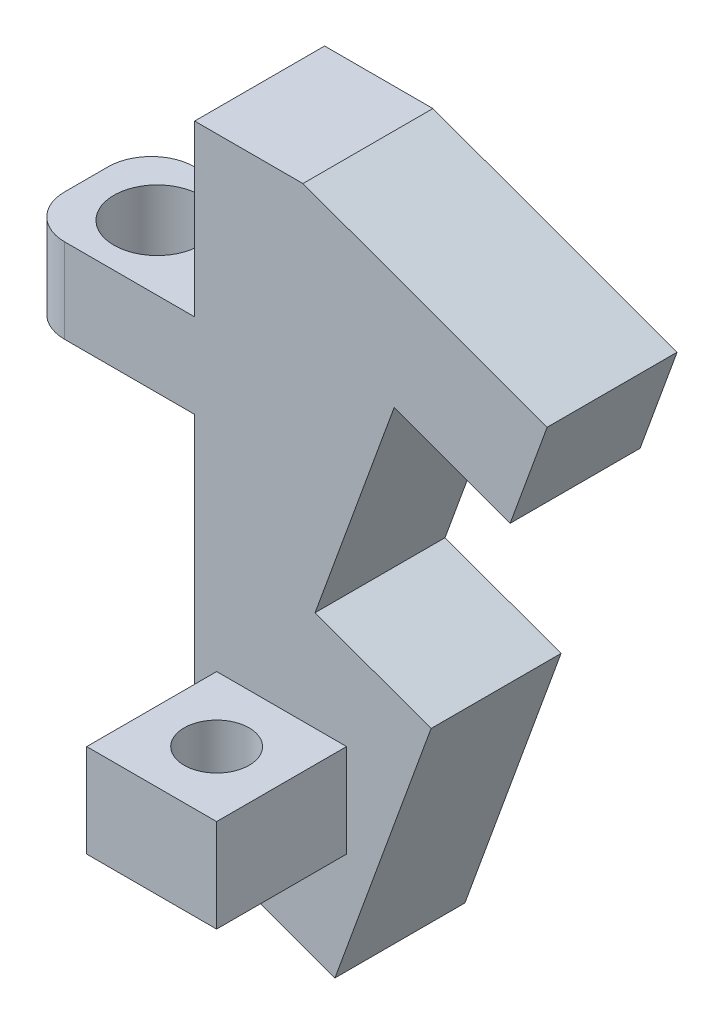
ISO-10303-21;
HEADER;
FILE_DESCRIPTION(('STEP AP214'),'2;1');
FILE_NAME('part.step','',(''),(''),'','','');
FILE_SCHEMA(('AUTOMOTIVE_DESIGN { 1 0 10303 214 1 1 1 1 }'));
ENDSEC;
DATA;
#1=APPLICATION_CONTEXT('core data for automotive mechanical design processes');
#2=APPLICATION_PROTOCOL_DEFINITION('international standard','automotive_design',2000,#1);
#3=PRODUCT_CONTEXT('',#1,'mechanical');
#4=PRODUCT('Part','Part','',(#3));
#5=PRODUCT_RELATED_PRODUCT_CATEGORY('part','',(#4));
#6=PRODUCT_DEFINITION_FORMATION('','',#4);
#7=PRODUCT_DEFINITION_CONTEXT('part definition',#1,'design');
#8=PRODUCT_DEFINITION('design','',#6,#7);
#9=PRODUCT_DEFINITION_SHAPE('','',#8);
#10=(LENGTH_UNIT() NAMED_UNIT(*) SI_UNIT(.MILLI.,.METRE.));
#11=(NAMED_UNIT(*) PLANE_ANGLE_UNIT() SI_UNIT($,.RADIAN.));
#12=(NAMED_UNIT(*) SI_UNIT($,.STERADIAN.) SOLID_ANGLE_UNIT());
#13=UNCERTAINTY_MEASURE_WITH_UNIT(LENGTH_MEASURE(1.E-05),#10,'distance_accuracy_value','');
#14=(GEOMETRIC_REPRESENTATION_CONTEXT(3) GLOBAL_UNCERTAINTY_ASSIGNED_CONTEXT((#13)) GLOBAL_UNIT_ASSIGNED_CONTEXT((#10,
#11,#12)) REPRESENTATION_CONTEXT('',''));
#15=CARTESIAN_POINT('',(0.,0.,0.));
#16=DIRECTION('',(0.,0.,1.));
#17=DIRECTION('',(1.,0.,0.));
#18=AXIS2_PLACEMENT_3D('',#15,#16,#17);
#19=CARTESIAN_POINT('',(0.,0.,6.));
#20=DIRECTION('',(0.,0.,-1.));
#21=DIRECTION('',(-1.,0.,0.));
#22=AXIS2_PLACEMENT_3D('',#19,#20,#21);
#23=PLANE('',#22);
#24=DIRECTION('',(1.,0.,0.));
#25=VECTOR('',#24,1.);
#26=CARTESIAN_POINT('',(-39.6100533156588,-21.1784228859534,6.));
#27=LINE('',#26,#25);
#28=CARTESIAN_POINT('',(-37.6100533156588,-21.1784228859534,6.));
#29=VERTEX_POINT('',#28);
#30=CARTESIAN_POINT('',(-31.6100533156588,-21.1784228859534,6.));
#31=VERTEX_POINT('',#30);
#32=EDGE_CURVE('E213',#29,#31,#27,.T.);
#33=ORIENTED_EDGE('',*,*,#32,.F.);
#34=DIRECTION('',(0.,1.,0.));
#35=VECTOR('',#34,1.);
#36=CARTESIAN_POINT('',(-37.6100533156588,-25.0784228859534,6.));
#37=LINE('',#36,#35);
#38=CARTESIAN_POINT('',(-37.6100533156588,-25.0784228859534,6.));
#39=VERTEX_POINT('',#38);
#40=EDGE_CURVE('E11',#29,#39,#37,.F.);
#41=ORIENTED_EDGE('',*,*,#40,.T.);
#42=DIRECTION('',(1.,0.,0.));
#43=VECTOR('',#42,1.);
#44=CARTESIAN_POINT('',(-39.6100533156588,-25.0784228859534,6.));
#45=LINE('',#44,#43);
#46=CARTESIAN_POINT('',(-31.6100533156588,-25.0784228859534,6.));
#47=VERTEX_POINT('',#46);
#48=EDGE_CURVE('E215',#39,#47,#45,.T.);
#49=ORIENTED_EDGE('',*,*,#48,.T.);
#50=DIRECTION('',(0.,-1.,0.));
#51=VECTOR('',#50,1.);
#52=CARTESIAN_POINT('',(-31.6100533156588,-42.0157924599474,6.));
#53=LINE('',#52,#51);
#54=CARTESIAN_POINT('',(-31.6100533156588,-42.0157924599474,6.));
#55=VERTEX_POINT('',#54);
#56=EDGE_CURVE('E224',#47,#55,#53,.T.);
#57=ORIENTED_EDGE('',*,*,#56,.T.);
#58=DIRECTION('',(0.939692620785908,-0.342020143325671,0.));
#59=VECTOR('',#58,1.);
#60=CARTESIAN_POINT('',(-31.6100533156588,-42.0157924599474,6.));
#61=LINE('',#60,#59);
#62=CARTESIAN_POINT('',(-25.1326189725083,-44.3733857552678,6.));
#63=VERTEX_POINT('',#62);
#64=EDGE_CURVE('E223',#55,#63,#61,.T.);
#65=ORIENTED_EDGE('',*,*,#64,.T.);
#66=DIRECTION('',(0.34202014332567,0.939692620785908,0.));
#67=VECTOR('',#66,1.);
#68=CARTESIAN_POINT('',(-20.6931975121411,-32.1761755374667,6.));
#69=LINE('',#68,#67);
#70=CARTESIAN_POINT('',(-20.6931975121411,-32.1761755374667,6.));
#71=VERTEX_POINT('',#70);
#72=EDGE_CURVE('E226',#63,#71,#69,.T.);
#73=ORIENTED_EDGE('',*,*,#72,.T.);
#74=DIRECTION('',(-0.939692620785908,0.34202014332567,0.));
#75=VECTOR('',#74,1.);
#76=CARTESIAN_POINT('',(-26.0494454506208,-30.2266607205104,6.));
#77=LINE('',#76,#75);
#78=CARTESIAN_POINT('',(-26.0494454506208,-30.2266607205104,6.));
#79=VERTEX_POINT('',#78);
#80=EDGE_CURVE('E228',#71,#79,#77,.T.);
#81=ORIENTED_EDGE('',*,*,#80,.T.);
#82=DIRECTION('',(0.34202014332567,0.939692620785908,0.));
#83=VECTOR('',#82,1.);
#84=CARTESIAN_POINT('',(-22.4000905213359,-20.2001404567248,6.));
#85=LINE('',#84,#83);
#86=CARTESIAN_POINT('',(-22.4000905213359,-20.2001404567248,6.));
#87=VERTEX_POINT('',#86);
#88=EDGE_CURVE('E230',#79,#87,#85,.T.);
#89=ORIENTED_EDGE('',*,*,#88,.T.);
#90=DIRECTION('',(0.939692620785908,-0.34202014332567,0.));
#91=VECTOR('',#90,1.);
#92=CARTESIAN_POINT('',(-17.0438425828562,-22.1496552736811,6.));
#93=LINE('',#92,#91);
#94=CARTESIAN_POINT('',(-17.0438425828562,-22.1496552736811,6.));
#95=VERTEX_POINT('',#94);
#96=EDGE_CURVE('E232',#87,#95,#93,.T.);
#97=ORIENTED_EDGE('',*,*,#96,.T.);
#98=DIRECTION('',(0.342020143325671,0.939692620785907,0.));
#99=VECTOR('',#98,1.);
#100=CARTESIAN_POINT('',(-17.0438425828562,-22.1496552736811,6.));
#101=LINE('',#100,#99);
#102=CARTESIAN_POINT('',(-15.3337418662279,-17.4511921697516,6.));
#103=VERTEX_POINT('',#102);
#104=EDGE_CURVE('E234',#95,#103,#101,.T.);
#105=ORIENTED_EDGE('',*,*,#104,.T.);
#106=DIRECTION('',(-0.939692620785908,0.34202014332567,0.));
#107=VECTOR('',#106,1.);
#108=CARTESIAN_POINT('',(-26.6100533156588,-13.3469504498435,6.));
#109=LINE('',#108,#107);
#110=CARTESIAN_POINT('',(-26.6100533156588,-13.3469504498435,6.));
#111=VERTEX_POINT('',#110);
#112=EDGE_CURVE('E236',#103,#111,#109,.T.);
#113=ORIENTED_EDGE('',*,*,#112,.T.);
#114=DIRECTION('',(-1.,0.,0.));
#115=VECTOR('',#114,1.);
#116=CARTESIAN_POINT('',(-31.6100533156588,-13.3469504498435,6.));
#117=LINE('',#116,#115);
#118=CARTESIAN_POINT('',(-31.6100533156588,-13.3469504498435,6.));
#119=VERTEX_POINT('',#118);
#120=EDGE_CURVE('E238',#111,#119,#117,.T.);
#121=ORIENTED_EDGE('',*,*,#120,.T.);
#122=EDGE_CURVE('E220',#119,#31,#53,.T.);
#123=ORIENTED_EDGE('',*,*,#122,.T.);
#124=EDGE_LOOP('',(#33,#41,#49,#57,#65,#73,#81,#89,#97,#105,#113,#121,#123));
#125=FACE_BOUND('',#124,.T.);
#126=DIRECTION('',(0.,-1.,0.));
#127=VECTOR('',#126,1.);
#128=CARTESIAN_POINT('',(-30.5932009442549,-34.8506686877667,6.));
#129=LINE('',#128,#127);
#130=CARTESIAN_POINT('',(-30.5932009442549,-34.8506686877667,6.));
#131=VERTEX_POINT('',#130);
#132=CARTESIAN_POINT('',(-30.5932009442549,-39.1506686877667,6.));
#133=VERTEX_POINT('',#132);
#134=EDGE_CURVE('E187',#131,#133,#129,.T.);
#135=ORIENTED_EDGE('',*,*,#134,.F.);
#136=DIRECTION('',(-1.,0.,0.));
#137=VECTOR('',#136,1.);
#138=CARTESIAN_POINT('',(-30.5932009442549,-34.8506686877667,6.));
#139=LINE('',#138,#137);
#140=CARTESIAN_POINT('',(-24.5966921283829,-34.8506686877667,6.));
#141=VERTEX_POINT('',#140);
#142=EDGE_CURVE('E184',#141,#131,#139,.T.);
#143=ORIENTED_EDGE('',*,*,#142,.F.);
#144=DIRECTION('',(0.,1.,0.));
#145=VECTOR('',#144,1.);
#146=CARTESIAN_POINT('',(-24.5966921283829,-34.8506686877667,6.));
#147=LINE('',#146,#145);
#148=CARTESIAN_POINT('',(-24.5966921283829,-39.1506686877667,6.));
#149=VERTEX_POINT('',#148);
#150=EDGE_CURVE('E57',#149,#141,#147,.T.);
#151=ORIENTED_EDGE('',*,*,#150,.F.);
#152=DIRECTION('',(1.,0.,0.));
#153=VECTOR('',#152,1.);
#154=CARTESIAN_POINT('',(-30.5932009442549,-39.1506686877667,6.));
#155=LINE('',#154,#153);
#156=EDGE_CURVE('E52',#133,#149,#155,.T.);
#157=ORIENTED_EDGE('',*,*,#156,.F.);
#158=EDGE_LOOP('',(#135,#143,#151,#157));
#159=FACE_BOUND('',#158,.T.);
#160=ADVANCED_FACE('F36',(#125,#159),#23,.F.);
#161=CARTESIAN_POINT('',(-31.6100533156588,-13.3469504498435,6.));
#162=DIRECTION('',(1.,0.,0.));
#163=DIRECTION('',(0.,1.,0.));
#164=AXIS2_PLACEMENT_3D('',#161,#162,#163);
#165=PLANE('',#164);
#166=DIRECTION('',(0.,0.,-1.));
#167=VECTOR('',#166,1.);
#168=CARTESIAN_POINT('',(-31.6100533156588,-21.1784228859534,0.));
#169=LINE('',#168,#167);
#170=CARTESIAN_POINT('',(-31.6100533156588,-21.1784228859534,0.));
#171=VERTEX_POINT('',#170);
#172=EDGE_CURVE('E204',#31,#171,#169,.T.);
#173=ORIENTED_EDGE('',*,*,#172,.F.);
#174=ORIENTED_EDGE('',*,*,#122,.F.);
#175=DIRECTION('',(0.,0.,-1.));
#176=VECTOR('',#175,1.);
#177=CARTESIAN_POINT('',(-31.6100533156588,-13.3469504498435,6.));
#178=LINE('',#177,#176);
#179=CARTESIAN_POINT('',(-31.6100533156588,-13.3469504498435,0.));
#180=VERTEX_POINT('',#179);
#181=EDGE_CURVE('E241',#119,#180,#178,.T.);
#182=ORIENTED_EDGE('',*,*,#181,.T.);
#183=DIRECTION('',(0.,-1.,0.));
#184=VECTOR('',#183,1.);
#185=CARTESIAN_POINT('',(-31.6100533156588,-13.3469504498435,0.));
#186=LINE('',#185,#184);
#187=EDGE_CURVE('E258',#180,#171,#186,.T.);
#188=ORIENTED_EDGE('',*,*,#187,.T.);
#189=EDGE_LOOP('',(#173,#174,#182,#188));
#190=FACE_BOUND('',#189,.T.);
#191=ADVANCED_FACE('F337',(#190),#165,.F.);
#192=DIRECTION('',(0.,0.,1.));
#193=VECTOR('',#192,1.);
#194=CARTESIAN_POINT('',(-31.6100533156588,-25.0784228859534,0.));
#195=LINE('',#194,#193);
#196=CARTESIAN_POINT('',(-31.6100533156588,-25.0784228859534,0.));
#197=VERTEX_POINT('',#196);
#198=EDGE_CURVE('E199',#197,#47,#195,.T.);
#199=ORIENTED_EDGE('',*,*,#198,.F.);
#200=CARTESIAN_POINT('',(-31.6100533156588,-42.0157924599474,0.));
#201=VERTEX_POINT('',#200);
#202=EDGE_CURVE('E257',#197,#201,#186,.T.);
#203=ORIENTED_EDGE('',*,*,#202,.T.);
#204=DIRECTION('',(0.,0.,-1.));
#205=VECTOR('',#204,1.);
#206=CARTESIAN_POINT('',(-31.6100533156588,-42.0157924599474,6.));
#207=LINE('',#206,#205);
#208=EDGE_CURVE('E284',#55,#201,#207,.T.);
#209=ORIENTED_EDGE('',*,*,#208,.F.);
#210=ORIENTED_EDGE('',*,*,#56,.F.);
#211=EDGE_LOOP('',(#199,#203,#209,#210));
#212=FACE_BOUND('',#211,.T.);
#213=ADVANCED_FACE('F325',(#212),#165,.F.);
#214=CARTESIAN_POINT('',(-31.6100533156588,-42.0157924599474,6.));
#215=DIRECTION('',(0.342020143325671,0.939692620785908,0.));
#216=DIRECTION('',(-0.939692620785908,0.342020143325671,0.));
#217=AXIS2_PLACEMENT_3D('',#214,#215,#216);
#218=PLANE('',#217);
#219=DIRECTION('',(0.939692620785908,-0.342020143325671,0.));
#220=VECTOR('',#219,1.);
#221=CARTESIAN_POINT('',(-31.6100533156588,-42.0157924599474,0.));
#222=LINE('',#221,#220);
#223=CARTESIAN_POINT('',(-25.1326189725083,-44.3733857552678,0.));
#224=VERTEX_POINT('',#223);
#225=EDGE_CURVE('E219',#201,#224,#222,.T.);
#226=ORIENTED_EDGE('',*,*,#225,.T.);
#227=DIRECTION('',(0.,0.,-1.));
#228=VECTOR('',#227,1.);
#229=CARTESIAN_POINT('',(-25.1326189725083,-44.3733857552678,6.));
#230=LINE('',#229,#228);
#231=EDGE_CURVE('E281',#63,#224,#230,.T.);
#232=ORIENTED_EDGE('',*,*,#231,.F.);
#233=ORIENTED_EDGE('',*,*,#64,.F.);
#234=ORIENTED_EDGE('',*,*,#208,.T.);
#235=EDGE_LOOP('',(#226,#232,#233,#234));
#236=FACE_BOUND('',#235,.T.);
#237=ADVANCED_FACE('F374',(#236),#218,.F.);
#238=CARTESIAN_POINT('',(-20.6931975121411,-32.1761755374667,6.));
#239=DIRECTION('',(-0.939692620785908,0.34202014332567,0.));
#240=DIRECTION('',(-0.34202014332567,-0.939692620785908,0.));
#241=AXIS2_PLACEMENT_3D('',#238,#239,#240);
#242=PLANE('',#241);
#243=DIRECTION('',(0.34202014332567,0.939692620785908,0.));
#244=VECTOR('',#243,1.);
#245=CARTESIAN_POINT('',(-20.6931975121411,-32.1761755374667,0.));
#246=LINE('',#245,#244);
#247=CARTESIAN_POINT('',(-20.6931975121411,-32.1761755374667,0.));
#248=VERTEX_POINT('',#247);
#249=EDGE_CURVE('E243',#224,#248,#246,.T.);
#250=ORIENTED_EDGE('',*,*,#249,.T.);
#251=DIRECTION('',(0.,0.,-1.));
#252=VECTOR('',#251,1.);
#253=CARTESIAN_POINT('',(-20.6931975121411,-32.1761755374667,6.));
#254=LINE('',#253,#252);
#255=EDGE_CURVE('E278',#71,#248,#254,.T.);
#256=ORIENTED_EDGE('',*,*,#255,.F.);
#257=ORIENTED_EDGE('',*,*,#72,.F.);
#258=ORIENTED_EDGE('',*,*,#231,.T.);
#259=EDGE_LOOP('',(#250,#256,#257,#258));
#260=FACE_BOUND('',#259,.T.);
#261=ADVANCED_FACE('F369',(#260),#242,.F.);
#262=CARTESIAN_POINT('',(-26.0494454506208,-30.2266607205104,6.));
#263=DIRECTION('',(-0.34202014332567,-0.939692620785908,0.));
#264=DIRECTION('',(0.939692620785908,-0.34202014332567,0.));
#265=AXIS2_PLACEMENT_3D('',#262,#263,#264);
#266=PLANE('',#265);
#267=DIRECTION('',(-0.939692620785908,0.34202014332567,0.));
#268=VECTOR('',#267,1.);
#269=CARTESIAN_POINT('',(-26.0494454506208,-30.2266607205104,0.));
#270=LINE('',#269,#268);
#271=CARTESIAN_POINT('',(-26.0494454506208,-30.2266607205104,0.));
#272=VERTEX_POINT('',#271);
#273=EDGE_CURVE('E245',#248,#272,#270,.T.);
#274=ORIENTED_EDGE('',*,*,#273,.T.);
#275=DIRECTION('',(0.,0.,-1.));
#276=VECTOR('',#275,1.);
#277=CARTESIAN_POINT('',(-26.0494454506208,-30.2266607205104,6.));
#278=LINE('',#277,#276);
#279=EDGE_CURVE('E275',#79,#272,#278,.T.);
#280=ORIENTED_EDGE('',*,*,#279,.F.);
#281=ORIENTED_EDGE('',*,*,#80,.F.);
#282=ORIENTED_EDGE('',*,*,#255,.T.);
#283=EDGE_LOOP('',(#274,#280,#281,#282));
#284=FACE_BOUND('',#283,.T.);
#285=ADVANCED_FACE('F366',(#284),#266,.F.);
#286=CARTESIAN_POINT('',(-22.4000905213359,-20.2001404567248,6.));
#287=DIRECTION('',(-0.939692620785908,0.34202014332567,0.));
#288=DIRECTION('',(-0.34202014332567,-0.939692620785908,0.));
#289=AXIS2_PLACEMENT_3D('',#286,#287,#288);
#290=PLANE('',#289);
#291=DIRECTION('',(0.34202014332567,0.939692620785908,0.));
#292=VECTOR('',#291,1.);
#293=CARTESIAN_POINT('',(-22.4000905213359,-20.2001404567248,0.));
#294=LINE('',#293,#292);
#295=CARTESIAN_POINT('',(-22.4000905213359,-20.2001404567248,0.));
#296=VERTEX_POINT('',#295);
#297=EDGE_CURVE('E247',#272,#296,#294,.T.);
#298=ORIENTED_EDGE('',*,*,#297,.T.);
#299=DIRECTION('',(0.,0.,-1.));
#300=VECTOR('',#299,1.);
#301=CARTESIAN_POINT('',(-22.4000905213359,-20.2001404567248,6.));
#302=LINE('',#301,#300);
#303=EDGE_CURVE('E272',#87,#296,#302,.T.);
#304=ORIENTED_EDGE('',*,*,#303,.F.);
#305=ORIENTED_EDGE('',*,*,#88,.F.);
#306=ORIENTED_EDGE('',*,*,#279,.T.);
#307=EDGE_LOOP('',(#298,#304,#305,#306));
#308=FACE_BOUND('',#307,.T.);
#309=ADVANCED_FACE('F362',(#308),#290,.F.);
#310=CARTESIAN_POINT('',(-17.0438425828562,-22.1496552736811,6.));
#311=DIRECTION('',(0.34202014332567,0.939692620785908,0.));
#312=DIRECTION('',(-0.939692620785908,0.34202014332567,0.));
#313=AXIS2_PLACEMENT_3D('',#310,#311,#312);
#314=PLANE('',#313);
#315=DIRECTION('',(0.939692620785908,-0.34202014332567,0.));
#316=VECTOR('',#315,1.);
#317=CARTESIAN_POINT('',(-17.0438425828562,-22.1496552736811,0.));
#318=LINE('',#317,#316);
#319=CARTESIAN_POINT('',(-17.0438425828562,-22.1496552736811,0.));
#320=VERTEX_POINT('',#319);
#321=EDGE_CURVE('E249',#296,#320,#318,.T.);
#322=ORIENTED_EDGE('',*,*,#321,.T.);
#323=DIRECTION('',(0.,0.,-1.));
#324=VECTOR('',#323,1.);
#325=CARTESIAN_POINT('',(-17.0438425828562,-22.1496552736811,6.));
#326=LINE('',#325,#324);
#327=EDGE_CURVE('E269',#95,#320,#326,.T.);
#328=ORIENTED_EDGE('',*,*,#327,.F.);
#329=ORIENTED_EDGE('',*,*,#96,.F.);
#330=ORIENTED_EDGE('',*,*,#303,.T.);
#331=EDGE_LOOP('',(#322,#328,#329,#330));
#332=FACE_BOUND('',#331,.T.);
#333=ADVANCED_FACE('F357',(#332),#314,.F.);
#334=CARTESIAN_POINT('',(-17.0438425828562,-22.1496552736811,6.));
#335=DIRECTION('',(-0.939692620785907,0.342020143325672,0.));
#336=DIRECTION('',(-0.342020143325672,-0.939692620785907,0.));
#337=AXIS2_PLACEMENT_3D('',#334,#335,#336);
#338=PLANE('',#337);
#339=DIRECTION('',(0.342020143325671,0.939692620785907,0.));
#340=VECTOR('',#339,1.);
#341=CARTESIAN_POINT('',(-17.0438425828562,-22.1496552736811,0.));
#342=LINE('',#341,#340);
#343=CARTESIAN_POINT('',(-15.3337418662279,-17.4511921697516,0.));
#344=VERTEX_POINT('',#343);
#345=EDGE_CURVE('E251',#320,#344,#342,.T.);
#346=ORIENTED_EDGE('',*,*,#345,.T.);
#347=DIRECTION('',(0.,0.,-1.));
#348=VECTOR('',#347,1.);
#349=CARTESIAN_POINT('',(-15.3337418662279,-17.4511921697516,6.));
#350=LINE('',#349,#348);
#351=EDGE_CURVE('E266',#103,#344,#350,.T.);
#352=ORIENTED_EDGE('',*,*,#351,.F.);
#353=ORIENTED_EDGE('',*,*,#104,.F.);
#354=ORIENTED_EDGE('',*,*,#327,.T.);
#355=EDGE_LOOP('',(#346,#352,#353,#354));
#356=FACE_BOUND('',#355,.T.);
#357=ADVANCED_FACE('F351',(#356),#338,.F.);
#358=CARTESIAN_POINT('',(-26.6100533156588,-13.3469504498435,6.));
#359=DIRECTION('',(-0.34202014332567,-0.939692620785908,0.));
#360=DIRECTION('',(0.939692620785908,-0.34202014332567,0.));
#361=AXIS2_PLACEMENT_3D('',#358,#359,#360);
#362=PLANE('',#361);
#363=DIRECTION('',(-0.939692620785908,0.34202014332567,0.));
#364=VECTOR('',#363,1.);
#365=CARTESIAN_POINT('',(-26.6100533156588,-13.3469504498435,0.));
#366=LINE('',#365,#364);
#367=CARTESIAN_POINT('',(-26.6100533156588,-13.3469504498435,0.));
#368=VERTEX_POINT('',#367);
#369=EDGE_CURVE('E253',#344,#368,#366,.T.);
#370=ORIENTED_EDGE('',*,*,#369,.T.);
#371=DIRECTION('',(0.,0.,-1.));
#372=VECTOR('',#371,1.);
#373=CARTESIAN_POINT('',(-26.6100533156588,-13.3469504498435,6.));
#374=LINE('',#373,#372);
#375=EDGE_CURVE('E263',#111,#368,#374,.T.);
#376=ORIENTED_EDGE('',*,*,#375,.F.);
#377=ORIENTED_EDGE('',*,*,#112,.F.);
#378=ORIENTED_EDGE('',*,*,#351,.T.);
#379=EDGE_LOOP('',(#370,#376,#377,#378));
#380=FACE_BOUND('',#379,.T.);
#381=ADVANCED_FACE('F347',(#380),#362,.F.);
#382=CARTESIAN_POINT('',(-31.6100533156588,-13.3469504498435,6.));
#383=DIRECTION('',(0.,-1.,0.));
#384=DIRECTION('',(1.,0.,0.));
#385=AXIS2_PLACEMENT_3D('',#382,#383,#384);
#386=PLANE('',#385);
#387=DIRECTION('',(-1.,0.,0.));
#388=VECTOR('',#387,1.);
#389=CARTESIAN_POINT('',(-31.6100533156588,-13.3469504498435,0.));
#390=LINE('',#389,#388);
#391=EDGE_CURVE('E255',#368,#180,#390,.T.);
#392=ORIENTED_EDGE('',*,*,#391,.T.);
#393=ORIENTED_EDGE('',*,*,#181,.F.);
#394=ORIENTED_EDGE('',*,*,#120,.F.);
#395=ORIENTED_EDGE('',*,*,#375,.T.);
#396=EDGE_LOOP('',(#392,#393,#394,#395));
#397=FACE_BOUND('',#396,.T.);
#398=ADVANCED_FACE('F343',(#397),#386,.F.);
#399=CARTESIAN_POINT('',(0.,0.,0.));
#400=DIRECTION('',(0.,0.,-1.));
#401=DIRECTION('',(-1.,0.,0.));
#402=AXIS2_PLACEMENT_3D('',#399,#400,#401);
#403=PLANE('',#402);
#404=DIRECTION('',(1.,0.,0.));
#405=VECTOR('',#404,1.);
#406=CARTESIAN_POINT('',(-39.6100533156588,-25.0784228859534,0.));
#407=LINE('',#406,#405);
#408=CARTESIAN_POINT('',(-37.6100533156588,-25.0784228859534,0.));
#409=VERTEX_POINT('',#408);
#410=EDGE_CURVE('E217',#409,#197,#407,.T.);
#411=ORIENTED_EDGE('',*,*,#410,.F.);
#412=DIRECTION('',(0.,-1.,0.));
#413=VECTOR('',#412,1.);
#414=CARTESIAN_POINT('',(-37.6100533156588,0.,0.));
#415=LINE('',#414,#413);
#416=CARTESIAN_POINT('',(-37.6100533156588,-21.1784228859534,0.));
#417=VERTEX_POINT('',#416);
#418=EDGE_CURVE('E297',#409,#417,#415,.F.);
#419=ORIENTED_EDGE('',*,*,#418,.T.);
#420=DIRECTION('',(1.,0.,0.));
#421=VECTOR('',#420,1.);
#422=CARTESIAN_POINT('',(-39.6100533156588,-21.1784228859534,0.));
#423=LINE('',#422,#421);
#424=EDGE_CURVE('E207',#417,#171,#423,.T.);
#425=ORIENTED_EDGE('',*,*,#424,.T.);
#426=ORIENTED_EDGE('',*,*,#187,.F.);
#427=ORIENTED_EDGE('',*,*,#391,.F.);
#428=ORIENTED_EDGE('',*,*,#369,.F.);
#429=ORIENTED_EDGE('',*,*,#345,.F.);
#430=ORIENTED_EDGE('',*,*,#321,.F.);
#431=ORIENTED_EDGE('',*,*,#297,.F.);
#432=ORIENTED_EDGE('',*,*,#273,.F.);
#433=ORIENTED_EDGE('',*,*,#249,.F.);
#434=ORIENTED_EDGE('',*,*,#225,.F.);
#435=ORIENTED_EDGE('',*,*,#202,.F.);
#436=EDGE_LOOP('',(#411,#419,#425,#426,#427,#428,#429,#430,#431,#432,#433,#434,#435));
#437=FACE_BOUND('',#436,.T.);
#438=ADVANCED_FACE('F320',(#437),#403,.T.);
#439=CARTESIAN_POINT('',(-39.6100533156588,-25.0784228859534,0.));
#440=DIRECTION('',(0.,1.,0.));
#441=DIRECTION('',(0.,0.,1.));
#442=AXIS2_PLACEMENT_3D('',#439,#440,#441);
#443=PLANE('',#442);
#444=CARTESIAN_POINT('',(-36.3394672665477,-25.0784228859534,3.));
#445=DIRECTION('',(0.,1.,0.));
#446=DIRECTION('',(0.,0.,1.));
#447=AXIS2_PLACEMENT_3D('',#444,#445,#446);
#448=CIRCLE('',#447,2.);
#449=CARTESIAN_POINT('',(-36.3394672665477,-25.0784228859534,5.));
#450=VERTEX_POINT('',#449);
#451=EDGE_CURVE('E191',#450,#450,#448,.T.);
#452=ORIENTED_EDGE('',*,*,#451,.T.);
#453=EDGE_LOOP('',(#452));
#454=FACE_BOUND('',#453,.T.);
#455=DIRECTION('',(0.,0.,1.));
#456=VECTOR('',#455,1.);
#457=CARTESIAN_POINT('',(-39.6100533156588,-25.0784228859534,0.));
#458=LINE('',#457,#456);
#459=CARTESIAN_POINT('',(-39.6100533156588,-25.0784228859534,2.));
#460=VERTEX_POINT('',#459);
#461=CARTESIAN_POINT('',(-39.6100533156588,-25.0784228859534,4.));
#462=VERTEX_POINT('',#461);
#463=EDGE_CURVE('E200',#460,#462,#458,.T.);
#464=ORIENTED_EDGE('',*,*,#463,.F.);
#465=CARTESIAN_POINT('',(-37.6100533156588,-25.0784228859534,2.));
#466=DIRECTION('',(0.,1.,0.));
#467=DIRECTION('',(0.,0.,1.));
#468=AXIS2_PLACEMENT_3D('',#465,#466,#467);
#469=CIRCLE('',#468,2.);
#470=EDGE_CURVE('E295',#460,#409,#469,.F.);
#471=ORIENTED_EDGE('',*,*,#470,.T.);
#472=ORIENTED_EDGE('',*,*,#410,.T.);
#473=ORIENTED_EDGE('',*,*,#198,.T.);
#474=ORIENTED_EDGE('',*,*,#48,.F.);
#475=CARTESIAN_POINT('',(-37.6100533156588,-25.0784228859534,4.));
#476=DIRECTION('',(0.,1.,0.));
#477=DIRECTION('',(0.,0.,1.));
#478=AXIS2_PLACEMENT_3D('',#475,#476,#477);
#479=CIRCLE('',#478,2.);
#480=EDGE_CURVE('E293',#39,#462,#479,.F.);
#481=ORIENTED_EDGE('',*,*,#480,.T.);
#482=EDGE_LOOP('',(#464,#471,#472,#473,#474,#481));
#483=FACE_BOUND('',#482,.T.);
#484=ADVANCED_FACE('F316',(#454,#483),#443,.F.);
#485=CARTESIAN_POINT('',(-39.6100533156588,-21.1784228859534,0.));
#486=DIRECTION('',(0.,-1.,0.));
#487=DIRECTION('',(0.,0.,-1.));
#488=AXIS2_PLACEMENT_3D('',#485,#486,#487);
#489=PLANE('',#488);
#490=CARTESIAN_POINT('',(-36.3394672665477,-21.1784228859534,3.));
#491=DIRECTION('',(0.,1.,0.));
#492=DIRECTION('',(0.,0.,1.));
#493=AXIS2_PLACEMENT_3D('',#490,#491,#492);
#494=CIRCLE('',#493,2.);
#495=CARTESIAN_POINT('',(-36.3394672665477,-21.1784228859534,5.));
#496=VERTEX_POINT('',#495);
#497=EDGE_CURVE('E188',#496,#496,#494,.T.);
#498=ORIENTED_EDGE('',*,*,#497,.F.);
#499=EDGE_LOOP('',(#498));
#500=FACE_BOUND('',#499,.T.);
#501=ORIENTED_EDGE('',*,*,#424,.F.);
#502=CARTESIAN_POINT('',(-37.6100533156588,-21.1784228859534,2.));
#503=DIRECTION('',(0.,-1.,0.));
#504=DIRECTION('',(0.,0.,-1.));
#505=AXIS2_PLACEMENT_3D('',#502,#503,#504);
#506=CIRCLE('',#505,2.);
#507=CARTESIAN_POINT('',(-39.6100533156588,-21.1784228859534,2.));
#508=VERTEX_POINT('',#507);
#509=EDGE_CURVE('E45',#417,#508,#506,.F.);
#510=ORIENTED_EDGE('',*,*,#509,.T.);
#511=DIRECTION('',(0.,0.,-1.));
#512=VECTOR('',#511,1.);
#513=CARTESIAN_POINT('',(-39.6100533156588,-21.1784228859534,0.));
#514=LINE('',#513,#512);
#515=CARTESIAN_POINT('',(-39.6100533156588,-21.1784228859534,4.));
#516=VERTEX_POINT('',#515);
#517=EDGE_CURVE('E203',#516,#508,#514,.T.);
#518=ORIENTED_EDGE('',*,*,#517,.F.);
#519=CARTESIAN_POINT('',(-37.6100533156588,-21.1784228859534,4.));
#520=DIRECTION('',(0.,-1.,0.));
#521=DIRECTION('',(0.,0.,-1.));
#522=AXIS2_PLACEMENT_3D('',#519,#520,#521);
#523=CIRCLE('',#522,2.);
#524=EDGE_CURVE('E299',#516,#29,#523,.F.);
#525=ORIENTED_EDGE('',*,*,#524,.T.);
#526=ORIENTED_EDGE('',*,*,#32,.T.);
#527=ORIENTED_EDGE('',*,*,#172,.T.);
#528=EDGE_LOOP('',(#501,#510,#518,#525,#526,#527));
#529=FACE_BOUND('',#528,.T.);
#530=ADVANCED_FACE('F305',(#500,#529),#489,.F.);
#531=CARTESIAN_POINT('',(-39.6100533156588,0.,0.));
#532=DIRECTION('',(-1.,0.,0.));
#533=DIRECTION('',(0.,0.,1.));
#534=AXIS2_PLACEMENT_3D('',#531,#532,#533);
#535=PLANE('',#534);
#536=ORIENTED_EDGE('',*,*,#517,.T.);
#537=DIRECTION('',(0.,-1.,0.));
#538=VECTOR('',#537,1.);
#539=CARTESIAN_POINT('',(-39.6100533156588,0.,2.));
#540=LINE('',#539,#538);
#541=EDGE_CURVE('E290',#508,#460,#540,.T.);
#542=ORIENTED_EDGE('',*,*,#541,.T.);
#543=ORIENTED_EDGE('',*,*,#463,.T.);
#544=DIRECTION('',(0.,1.,0.));
#545=VECTOR('',#544,1.);
#546=CARTESIAN_POINT('',(-39.6100533156588,-21.1784228859534,4.));
#547=LINE('',#546,#545);
#548=EDGE_CURVE('E287',#462,#516,#547,.T.);
#549=ORIENTED_EDGE('',*,*,#548,.T.);
#550=EDGE_LOOP('',(#536,#542,#543,#549));
#551=FACE_BOUND('',#550,.T.);
#552=ADVANCED_FACE('F310',(#551),#535,.T.);
#553=CARTESIAN_POINT('',(-36.3394672665477,-44.3733857552678,3.));
#554=DIRECTION('',(0.,1.,0.));
#555=DIRECTION('',(0.,0.,1.));
#556=AXIS2_PLACEMENT_3D('',#553,#554,#555);
#557=CYLINDRICAL_SURFACE('',#556,2.);
#558=ORIENTED_EDGE('',*,*,#497,.T.);
#559=EDGE_LOOP('',(#558));
#560=FACE_BOUND('',#559,.T.);
#561=ORIENTED_EDGE('',*,*,#451,.F.);
#562=EDGE_LOOP('',(#561));
#563=FACE_BOUND('',#562,.T.);
#564=ADVANCED_FACE('F452',(#560,#563),#557,.F.);
#565=CARTESIAN_POINT('',(-37.6100533156588,0.,2.));
#566=DIRECTION('',(0.,-1.,0.));
#567=DIRECTION('',(0.,0.,-1.));
#568=AXIS2_PLACEMENT_3D('',#565,#566,#567);
#569=CYLINDRICAL_SURFACE('',#568,2.);
#570=ORIENTED_EDGE('',*,*,#509,.F.);
#571=ORIENTED_EDGE('',*,*,#418,.F.);
#572=ORIENTED_EDGE('',*,*,#470,.F.);
#573=ORIENTED_EDGE('',*,*,#541,.F.);
#574=EDGE_LOOP('',(#570,#571,#572,#573));
#575=FACE_BOUND('',#574,.T.);
#576=ADVANCED_FACE('F313',(#575),#569,.T.);
#577=CARTESIAN_POINT('',(-37.6100533156588,0.,4.));
#578=DIRECTION('',(0.,-1.,0.));
#579=DIRECTION('',(0.,0.,-1.));
#580=AXIS2_PLACEMENT_3D('',#577,#578,#579);
#581=CYLINDRICAL_SURFACE('',#580,2.);
#582=ORIENTED_EDGE('',*,*,#480,.F.);
#583=ORIENTED_EDGE('',*,*,#40,.F.);
#584=ORIENTED_EDGE('',*,*,#524,.F.);
#585=ORIENTED_EDGE('',*,*,#548,.F.);
#586=EDGE_LOOP('',(#582,#583,#584,#585));
#587=FACE_BOUND('',#586,.T.);
#588=ADVANCED_FACE('F38',(#587),#581,.T.);
#589=CARTESIAN_POINT('',(-30.5932009442549,-34.8506686877667,12.));
#590=DIRECTION('',(1.,0.,0.));
#591=DIRECTION('',(0.,1.,0.));
#592=AXIS2_PLACEMENT_3D('',#589,#590,#591);
#593=PLANE('',#592);
#594=ORIENTED_EDGE('',*,*,#134,.T.);
#595=DIRECTION('',(0.,0.,-1.));
#596=VECTOR('',#595,1.);
#597=CARTESIAN_POINT('',(-30.5932009442549,-39.1506686877667,12.));
#598=LINE('',#597,#596);
#599=CARTESIAN_POINT('',(-30.5932009442549,-39.1506686877667,12.));
#600=VERTEX_POINT('',#599);
#601=EDGE_CURVE('E168',#600,#133,#598,.T.);
#602=ORIENTED_EDGE('',*,*,#601,.F.);
#603=DIRECTION('',(0.,-1.,0.));
#604=VECTOR('',#603,1.);
#605=CARTESIAN_POINT('',(-30.5932009442549,-34.8506686877667,12.));
#606=LINE('',#605,#604);
#607=CARTESIAN_POINT('',(-30.5932009442549,-34.8506686877667,12.));
#608=VERTEX_POINT('',#607);
#609=EDGE_CURVE('E175',#608,#600,#606,.T.);
#610=ORIENTED_EDGE('',*,*,#609,.F.);
#611=DIRECTION('',(0.,0.,-1.));
#612=VECTOR('',#611,1.);
#613=CARTESIAN_POINT('',(-30.5932009442549,-34.8506686877667,12.));
#614=LINE('',#613,#612);
#615=EDGE_CURVE('E597',#608,#131,#614,.T.);
#616=ORIENTED_EDGE('',*,*,#615,.T.);
#617=EDGE_LOOP('',(#594,#602,#610,#616));
#618=FACE_BOUND('',#617,.T.);
#619=ADVANCED_FACE('F186',(#618),#593,.F.);
#620=CARTESIAN_POINT('',(-30.5932009442549,-39.1506686877667,12.));
#621=DIRECTION('',(0.,1.,0.));
#622=DIRECTION('',(0.,0.,1.));
#623=AXIS2_PLACEMENT_3D('',#620,#621,#622);
#624=PLANE('',#623);
#625=CARTESIAN_POINT('',(-27.5949465363189,-39.1506686877667,9.));
#626=DIRECTION('',(0.,-1.,0.));
#627=DIRECTION('',(0.,0.,-1.));
#628=AXIS2_PLACEMENT_3D('',#625,#626,#627);
#629=CIRCLE('',#628,1.5);
#630=CARTESIAN_POINT('',(-27.5949465363189,-39.1506686877667,7.5));
#631=VERTEX_POINT('',#630);
#632=EDGE_CURVE('E590',#631,#631,#629,.T.);
#633=ORIENTED_EDGE('',*,*,#632,.F.);
#634=EDGE_LOOP('',(#633));
#635=FACE_BOUND('',#634,.T.);
#636=ORIENTED_EDGE('',*,*,#156,.T.);
#637=DIRECTION('',(0.,0.,-1.));
#638=VECTOR('',#637,1.);
#639=CARTESIAN_POINT('',(-24.5966921283829,-39.1506686877667,12.));
#640=LINE('',#639,#638);
#641=CARTESIAN_POINT('',(-24.5966921283829,-39.1506686877667,12.));
#642=VERTEX_POINT('',#641);
#643=EDGE_CURVE('E171',#642,#149,#640,.T.);
#644=ORIENTED_EDGE('',*,*,#643,.F.);
#645=DIRECTION('',(1.,0.,0.));
#646=VECTOR('',#645,1.);
#647=CARTESIAN_POINT('',(-30.5932009442549,-39.1506686877667,12.));
#648=LINE('',#647,#646);
#649=EDGE_CURVE('E164',#600,#642,#648,.T.);
#650=ORIENTED_EDGE('',*,*,#649,.F.);
#651=ORIENTED_EDGE('',*,*,#601,.T.);
#652=EDGE_LOOP('',(#636,#644,#650,#651));
#653=FACE_BOUND('',#652,.T.);
#654=ADVANCED_FACE('F166',(#635,#653),#624,.F.);
#655=CARTESIAN_POINT('',(-24.5966921283829,-34.8506686877667,12.));
#656=DIRECTION('',(-1.,0.,0.));
#657=DIRECTION('',(0.,0.,1.));
#658=AXIS2_PLACEMENT_3D('',#655,#656,#657);
#659=PLANE('',#658);
#660=ORIENTED_EDGE('',*,*,#150,.T.);
#661=DIRECTION('',(0.,0.,-1.));
#662=VECTOR('',#661,1.);
#663=CARTESIAN_POINT('',(-24.5966921283829,-34.8506686877667,12.));
#664=LINE('',#663,#662);
#665=CARTESIAN_POINT('',(-24.5966921283829,-34.8506686877667,12.));
#666=VERTEX_POINT('',#665);
#667=EDGE_CURVE('E193',#666,#141,#664,.T.);
#668=ORIENTED_EDGE('',*,*,#667,.F.);
#669=DIRECTION('',(0.,1.,0.));
#670=VECTOR('',#669,1.);
#671=CARTESIAN_POINT('',(-24.5966921283829,-34.8506686877667,12.));
#672=LINE('',#671,#670);
#673=EDGE_CURVE('E174',#642,#666,#672,.T.);
#674=ORIENTED_EDGE('',*,*,#673,.F.);
#675=ORIENTED_EDGE('',*,*,#643,.T.);
#676=EDGE_LOOP('',(#660,#668,#674,#675));
#677=FACE_BOUND('',#676,.T.);
#678=ADVANCED_FACE('F483',(#677),#659,.F.);
#679=CARTESIAN_POINT('',(-30.5932009442549,-34.8506686877667,12.));
#680=DIRECTION('',(0.,-1.,0.));
#681=DIRECTION('',(0.,0.,-1.));
#682=AXIS2_PLACEMENT_3D('',#679,#680,#681);
#683=PLANE('',#682);
#684=CARTESIAN_POINT('',(-27.5949465363189,-34.8506686877667,9.));
#685=DIRECTION('',(0.,-1.,0.));
#686=DIRECTION('',(0.,0.,-1.));
#687=AXIS2_PLACEMENT_3D('',#684,#685,#686);
#688=CIRCLE('',#687,1.5);
#689=CARTESIAN_POINT('',(-27.5949465363189,-34.8506686877667,7.5));
#690=VERTEX_POINT('',#689);
#691=EDGE_CURVE('E40',#690,#690,#688,.T.);
#692=ORIENTED_EDGE('',*,*,#691,.T.);
#693=EDGE_LOOP('',(#692));
#694=FACE_BOUND('',#693,.T.);
#695=ORIENTED_EDGE('',*,*,#142,.T.);
#696=ORIENTED_EDGE('',*,*,#615,.F.);
#697=DIRECTION('',(-1.,0.,0.));
#698=VECTOR('',#697,1.);
#699=CARTESIAN_POINT('',(-30.5932009442549,-34.8506686877667,12.));
#700=LINE('',#699,#698);
#701=EDGE_CURVE('E180',#666,#608,#700,.T.);
#702=ORIENTED_EDGE('',*,*,#701,.F.);
#703=ORIENTED_EDGE('',*,*,#667,.T.);
#704=EDGE_LOOP('',(#695,#696,#702,#703));
#705=FACE_BOUND('',#704,.T.);
#706=ADVANCED_FACE('F492',(#694,#705),#683,.F.);
#707=CARTESIAN_POINT('',(0.,0.,12.));
#708=DIRECTION('',(0.,0.,1.));
#709=DIRECTION('',(1.,0.,0.));
#710=AXIS2_PLACEMENT_3D('',#707,#708,#709);
#711=PLANE('',#710);
#712=ORIENTED_EDGE('',*,*,#609,.T.);
#713=ORIENTED_EDGE('',*,*,#649,.T.);
#714=ORIENTED_EDGE('',*,*,#673,.T.);
#715=ORIENTED_EDGE('',*,*,#701,.T.);
#716=EDGE_LOOP('',(#712,#713,#714,#715));
#717=FACE_BOUND('',#716,.T.);
#718=ADVANCED_FACE('F178',(#717),#711,.T.);
#719=CARTESIAN_POINT('',(-27.5949465363189,-13.3469504498435,9.));
#720=DIRECTION('',(0.,-1.,0.));
#721=DIRECTION('',(0.,0.,-1.));
#722=AXIS2_PLACEMENT_3D('',#719,#720,#721);
#723=CYLINDRICAL_SURFACE('',#722,1.5);
#724=ORIENTED_EDGE('',*,*,#632,.T.);
#725=EDGE_LOOP('',(#724));
#726=FACE_BOUND('',#725,.T.);
#727=ORIENTED_EDGE('',*,*,#691,.F.);
#728=EDGE_LOOP('',(#727));
#729=FACE_BOUND('',#728,.T.);
#730=ADVANCED_FACE('F506',(#726,#729),#723,.F.);
#731=CLOSED_SHELL('',(#160,#191,#213,#237,#261,#285,#309,#333,#357,#381,#398,#438,#484,#530,
#552,#564,#576,#588,#619,#654,#678,#706,#718,#730));
#732=MANIFOLD_SOLID_BREP('B2',#731);
#733=ADVANCED_BREP_SHAPE_REPRESENTATION('',(#18,#732),#14);
#734=SHAPE_DEFINITION_REPRESENTATION(#9,#733);
ENDSEC;
END-ISO-10303-21;
